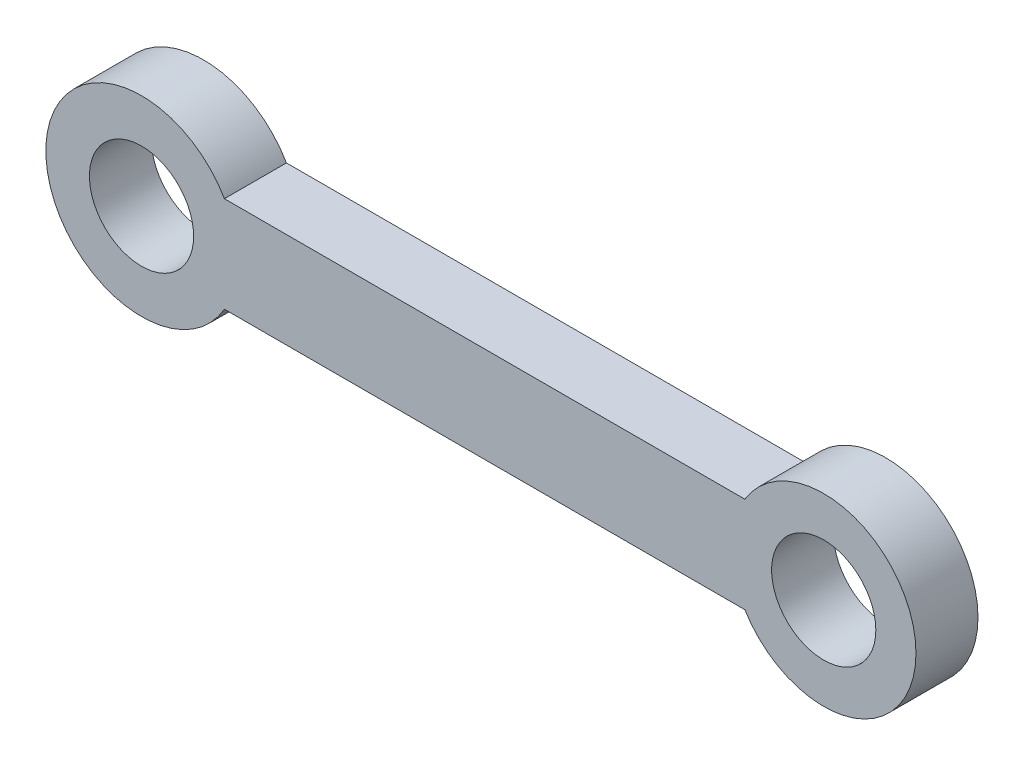
ISO-10303-21;
HEADER;
FILE_DESCRIPTION(('STEP AP214'),'2;1');
FILE_NAME('part.step','',(''),(''),'','','');
FILE_SCHEMA(('AUTOMOTIVE_DESIGN { 1 0 10303 214 1 1 1 1 }'));
ENDSEC;
DATA;
#1=APPLICATION_CONTEXT('core data for automotive mechanical design processes');
#2=APPLICATION_PROTOCOL_DEFINITION('international standard','automotive_design',2000,#1);
#3=PRODUCT_CONTEXT('',#1,'mechanical');
#4=PRODUCT('Part','Part','',(#3));
#5=PRODUCT_RELATED_PRODUCT_CATEGORY('part','',(#4));
#6=PRODUCT_DEFINITION_FORMATION('','',#4);
#7=PRODUCT_DEFINITION_CONTEXT('part definition',#1,'design');
#8=PRODUCT_DEFINITION('design','',#6,#7);
#9=PRODUCT_DEFINITION_SHAPE('','',#8);
#10=(LENGTH_UNIT() NAMED_UNIT(*) SI_UNIT(.MILLI.,.METRE.));
#11=(NAMED_UNIT(*) PLANE_ANGLE_UNIT() SI_UNIT($,.RADIAN.));
#12=(NAMED_UNIT(*) SI_UNIT($,.STERADIAN.) SOLID_ANGLE_UNIT());
#13=UNCERTAINTY_MEASURE_WITH_UNIT(LENGTH_MEASURE(1.E-05),#10,'distance_accuracy_value','');
#14=(GEOMETRIC_REPRESENTATION_CONTEXT(3) GLOBAL_UNCERTAINTY_ASSIGNED_CONTEXT((#13)) GLOBAL_UNIT_ASSIGNED_CONTEXT((#10,
#11,#12)) REPRESENTATION_CONTEXT('',''));
#15=CARTESIAN_POINT('',(0.,0.,0.));
#16=DIRECTION('',(0.,0.,1.));
#17=DIRECTION('',(1.,0.,0.));
#18=AXIS2_PLACEMENT_3D('',#15,#16,#17);
#19=CARTESIAN_POINT('',(-27.5,0.,5.));
#20=DIRECTION('',(0.,0.,1.));
#21=DIRECTION('',(1.,0.,0.));
#22=AXIS2_PLACEMENT_3D('',#19,#20,#21);
#23=PLANE('',#22);
#24=CARTESIAN_POINT('',(-27.5,0.,5.));
#25=DIRECTION('',(0.,0.,1.));
#26=DIRECTION('',(1.,0.,0.));
#27=AXIS2_PLACEMENT_3D('',#24,#25,#26);
#28=CIRCLE('',#27,4.2);
#29=CARTESIAN_POINT('',(-23.3,0.,5.));
#30=VERTEX_POINT('',#29);
#31=EDGE_CURVE('E105',#30,#30,#28,.T.);
#32=ORIENTED_EDGE('',*,*,#31,.F.);
#33=EDGE_LOOP('',(#32));
#34=FACE_BOUND('',#33,.T.);
#35=CARTESIAN_POINT('',(-27.5,0.,5.));
#36=DIRECTION('',(0.,0.,1.));
#37=DIRECTION('',(1.,0.,0.));
#38=AXIS2_PLACEMENT_3D('',#35,#36,#37);
#39=CIRCLE('',#38,7.71589646239066);
#40=CARTESIAN_POINT('',(-20.8178376505992,3.85794823119534,5.));
#41=VERTEX_POINT('',#40);
#42=CARTESIAN_POINT('',(-20.8178376505992,-3.85794823119532,5.));
#43=VERTEX_POINT('',#42);
#44=EDGE_CURVE('E90',#41,#43,#39,.T.);
#45=ORIENTED_EDGE('',*,*,#44,.T.);
#46=DIRECTION('',(1.,0.,0.));
#47=VECTOR('',#46,1.);
#48=CARTESIAN_POINT('',(-20.8178376505992,-3.85794823119532,5.));
#49=LINE('',#48,#47);
#50=CARTESIAN_POINT('',(21.1410627474599,-3.85794823119533,5.));
#51=VERTEX_POINT('',#50);
#52=EDGE_CURVE('E85',#43,#51,#49,.T.);
#53=ORIENTED_EDGE('',*,*,#52,.T.);
#54=CARTESIAN_POINT('',(27.5,0.,5.));
#55=DIRECTION('',(0.,0.,1.));
#56=DIRECTION('',(1.,0.,0.));
#57=AXIS2_PLACEMENT_3D('',#54,#55,#56);
#58=CIRCLE('',#57,7.43773134338191);
#59=CARTESIAN_POINT('',(21.1410627474599,3.85794823119534,5.));
#60=VERTEX_POINT('',#59);
#61=EDGE_CURVE('E88',#51,#60,#58,.T.);
#62=ORIENTED_EDGE('',*,*,#61,.T.);
#63=DIRECTION('',(-1.,0.,0.));
#64=VECTOR('',#63,1.);
#65=CARTESIAN_POINT('',(-20.8178376505992,3.85794823119534,5.));
#66=LINE('',#65,#64);
#67=EDGE_CURVE('E55',#60,#41,#66,.T.);
#68=ORIENTED_EDGE('',*,*,#67,.T.);
#69=EDGE_LOOP('',(#45,#53,#62,#68));
#70=FACE_BOUND('',#69,.T.);
#71=CARTESIAN_POINT('',(27.5,0.,5.));
#72=DIRECTION('',(0.,0.,1.));
#73=DIRECTION('',(1.,0.,0.));
#74=AXIS2_PLACEMENT_3D('',#71,#72,#73);
#75=CIRCLE('',#74,4.2);
#76=CARTESIAN_POINT('',(31.7,0.,5.));
#77=VERTEX_POINT('',#76);
#78=EDGE_CURVE('E120',#77,#77,#75,.T.);
#79=ORIENTED_EDGE('',*,*,#78,.F.);
#80=EDGE_LOOP('',(#79));
#81=FACE_BOUND('',#80,.T.);
#82=ADVANCED_FACE('F38',(#34,#70,#81),#23,.T.);
#83=CARTESIAN_POINT('',(-27.5,0.,0.));
#84=DIRECTION('',(0.,0.,1.));
#85=DIRECTION('',(1.,0.,0.));
#86=AXIS2_PLACEMENT_3D('',#83,#84,#85);
#87=PLANE('',#86);
#88=CARTESIAN_POINT('',(-27.5,0.,0.));
#89=DIRECTION('',(0.,0.,1.));
#90=DIRECTION('',(1.,0.,0.));
#91=AXIS2_PLACEMENT_3D('',#88,#89,#90);
#92=CIRCLE('',#91,7.71589646239066);
#93=CARTESIAN_POINT('',(-20.8178376505992,3.85794823119534,0.));
#94=VERTEX_POINT('',#93);
#95=CARTESIAN_POINT('',(-20.8178376505992,-3.85794823119532,0.));
#96=VERTEX_POINT('',#95);
#97=EDGE_CURVE('E102',#94,#96,#92,.T.);
#98=ORIENTED_EDGE('',*,*,#97,.F.);
#99=DIRECTION('',(-1.,0.,0.));
#100=VECTOR('',#99,1.);
#101=CARTESIAN_POINT('',(-20.8178376505992,3.85794823119534,0.));
#102=LINE('',#101,#100);
#103=CARTESIAN_POINT('',(21.1410627474599,3.85794823119534,0.));
#104=VERTEX_POINT('',#103);
#105=EDGE_CURVE('E78',#104,#94,#102,.T.);
#106=ORIENTED_EDGE('',*,*,#105,.F.);
#107=CARTESIAN_POINT('',(27.5,0.,0.));
#108=DIRECTION('',(0.,0.,1.));
#109=DIRECTION('',(1.,0.,0.));
#110=AXIS2_PLACEMENT_3D('',#107,#108,#109);
#111=CIRCLE('',#110,7.43773134338191);
#112=CARTESIAN_POINT('',(21.1410627474599,-3.85794823119533,0.));
#113=VERTEX_POINT('',#112);
#114=EDGE_CURVE('E72',#113,#104,#111,.T.);
#115=ORIENTED_EDGE('',*,*,#114,.F.);
#116=DIRECTION('',(1.,0.,0.));
#117=VECTOR('',#116,1.);
#118=CARTESIAN_POINT('',(-20.8178376505992,-3.85794823119532,0.));
#119=LINE('',#118,#117);
#120=EDGE_CURVE('E94',#96,#113,#119,.T.);
#121=ORIENTED_EDGE('',*,*,#120,.F.);
#122=EDGE_LOOP('',(#98,#106,#115,#121));
#123=FACE_BOUND('',#122,.T.);
#124=CARTESIAN_POINT('',(-27.5,0.,0.));
#125=DIRECTION('',(0.,0.,1.));
#126=DIRECTION('',(1.,0.,0.));
#127=AXIS2_PLACEMENT_3D('',#124,#125,#126);
#128=CIRCLE('',#127,4.2);
#129=CARTESIAN_POINT('',(-23.3,0.,0.));
#130=VERTEX_POINT('',#129);
#131=EDGE_CURVE('E117',#130,#130,#128,.T.);
#132=ORIENTED_EDGE('',*,*,#131,.T.);
#133=EDGE_LOOP('',(#132));
#134=FACE_BOUND('',#133,.T.);
#135=CARTESIAN_POINT('',(27.5,0.,0.));
#136=DIRECTION('',(0.,0.,1.));
#137=DIRECTION('',(1.,0.,0.));
#138=AXIS2_PLACEMENT_3D('',#135,#136,#137);
#139=CIRCLE('',#138,4.2);
#140=CARTESIAN_POINT('',(31.7,0.,0.));
#141=VERTEX_POINT('',#140);
#142=EDGE_CURVE('E123',#141,#141,#139,.T.);
#143=ORIENTED_EDGE('',*,*,#142,.T.);
#144=EDGE_LOOP('',(#143));
#145=FACE_BOUND('',#144,.T.);
#146=ADVANCED_FACE('F113',(#123,#134,#145),#87,.F.);
#147=CARTESIAN_POINT('',(-27.5,0.,5.));
#148=DIRECTION('',(0.,0.,-1.));
#149=DIRECTION('',(-1.,0.,0.));
#150=AXIS2_PLACEMENT_3D('',#147,#148,#149);
#151=CYLINDRICAL_SURFACE('',#150,7.71589646239066);
#152=ORIENTED_EDGE('',*,*,#97,.T.);
#153=DIRECTION('',(0.,0.,-1.));
#154=VECTOR('',#153,1.);
#155=CARTESIAN_POINT('',(-20.8178376505992,-3.85794823119532,5.));
#156=LINE('',#155,#154);
#157=EDGE_CURVE('E11',#43,#96,#156,.T.);
#158=ORIENTED_EDGE('',*,*,#157,.F.);
#159=ORIENTED_EDGE('',*,*,#44,.F.);
#160=DIRECTION('',(0.,0.,-1.));
#161=VECTOR('',#160,1.);
#162=CARTESIAN_POINT('',(-20.8178376505992,3.85794823119534,5.));
#163=LINE('',#162,#161);
#164=EDGE_CURVE('E98',#41,#94,#163,.T.);
#165=ORIENTED_EDGE('',*,*,#164,.T.);
#166=EDGE_LOOP('',(#152,#158,#159,#165));
#167=FACE_BOUND('',#166,.T.);
#168=ADVANCED_FACE('F40',(#167),#151,.T.);
#169=CARTESIAN_POINT('',(-20.8178376505992,-3.85794823119532,5.));
#170=DIRECTION('',(0.,1.,0.));
#171=DIRECTION('',(-1.,0.,0.));
#172=AXIS2_PLACEMENT_3D('',#169,#170,#171);
#173=PLANE('',#172);
#174=ORIENTED_EDGE('',*,*,#120,.T.);
#175=DIRECTION('',(0.,0.,-1.));
#176=VECTOR('',#175,1.);
#177=CARTESIAN_POINT('',(21.1410627474599,-3.85794823119533,5.));
#178=LINE('',#177,#176);
#179=EDGE_CURVE('E47',#51,#113,#178,.T.);
#180=ORIENTED_EDGE('',*,*,#179,.F.);
#181=ORIENTED_EDGE('',*,*,#52,.F.);
#182=ORIENTED_EDGE('',*,*,#157,.T.);
#183=EDGE_LOOP('',(#174,#180,#181,#182));
#184=FACE_BOUND('',#183,.T.);
#185=ADVANCED_FACE('F93',(#184),#173,.F.);
#186=CARTESIAN_POINT('',(27.5,0.,5.));
#187=DIRECTION('',(0.,0.,-1.));
#188=DIRECTION('',(-1.,0.,0.));
#189=AXIS2_PLACEMENT_3D('',#186,#187,#188);
#190=CYLINDRICAL_SURFACE('',#189,7.43773134338191);
#191=ORIENTED_EDGE('',*,*,#114,.T.);
#192=DIRECTION('',(0.,0.,-1.));
#193=VECTOR('',#192,1.);
#194=CARTESIAN_POINT('',(21.1410627474599,3.85794823119534,5.));
#195=LINE('',#194,#193);
#196=EDGE_CURVE('E95',#60,#104,#195,.T.);
#197=ORIENTED_EDGE('',*,*,#196,.F.);
#198=ORIENTED_EDGE('',*,*,#61,.F.);
#199=ORIENTED_EDGE('',*,*,#179,.T.);
#200=EDGE_LOOP('',(#191,#197,#198,#199));
#201=FACE_BOUND('',#200,.T.);
#202=ADVANCED_FACE('F96',(#201),#190,.T.);
#203=CARTESIAN_POINT('',(-20.8178376505992,3.85794823119534,5.));
#204=DIRECTION('',(0.,-1.,0.));
#205=DIRECTION('',(1.,0.,0.));
#206=AXIS2_PLACEMENT_3D('',#203,#204,#205);
#207=PLANE('',#206);
#208=ORIENTED_EDGE('',*,*,#105,.T.);
#209=ORIENTED_EDGE('',*,*,#164,.F.);
#210=ORIENTED_EDGE('',*,*,#67,.F.);
#211=ORIENTED_EDGE('',*,*,#196,.T.);
#212=EDGE_LOOP('',(#208,#209,#210,#211));
#213=FACE_BOUND('',#212,.T.);
#214=ADVANCED_FACE('F110',(#213),#207,.F.);
#215=CARTESIAN_POINT('',(-27.5,0.,5.));
#216=DIRECTION('',(0.,0.,-1.));
#217=DIRECTION('',(-1.,0.,0.));
#218=AXIS2_PLACEMENT_3D('',#215,#216,#217);
#219=CYLINDRICAL_SURFACE('',#218,4.2);
#220=ORIENTED_EDGE('',*,*,#31,.T.);
#221=EDGE_LOOP('',(#220));
#222=FACE_BOUND('',#221,.T.);
#223=ORIENTED_EDGE('',*,*,#131,.F.);
#224=EDGE_LOOP('',(#223));
#225=FACE_BOUND('',#224,.T.);
#226=ADVANCED_FACE('F140',(#222,#225),#219,.F.);
#227=CARTESIAN_POINT('',(27.5,0.,5.));
#228=DIRECTION('',(0.,0.,-1.));
#229=DIRECTION('',(-1.,0.,0.));
#230=AXIS2_PLACEMENT_3D('',#227,#228,#229);
#231=CYLINDRICAL_SURFACE('',#230,4.2);
#232=ORIENTED_EDGE('',*,*,#78,.T.);
#233=EDGE_LOOP('',(#232));
#234=FACE_BOUND('',#233,.T.);
#235=ORIENTED_EDGE('',*,*,#142,.F.);
#236=EDGE_LOOP('',(#235));
#237=FACE_BOUND('',#236,.T.);
#238=ADVANCED_FACE('F129',(#234,#237),#231,.F.);
#239=CLOSED_SHELL('',(#82,#146,#168,#185,#202,#214,#226,#238));
#240=MANIFOLD_SOLID_BREP('B2',#239);
#241=ADVANCED_BREP_SHAPE_REPRESENTATION('',(#18,#240),#14);
#242=SHAPE_DEFINITION_REPRESENTATION(#9,#241);
ENDSEC;
END-ISO-10303-21;
